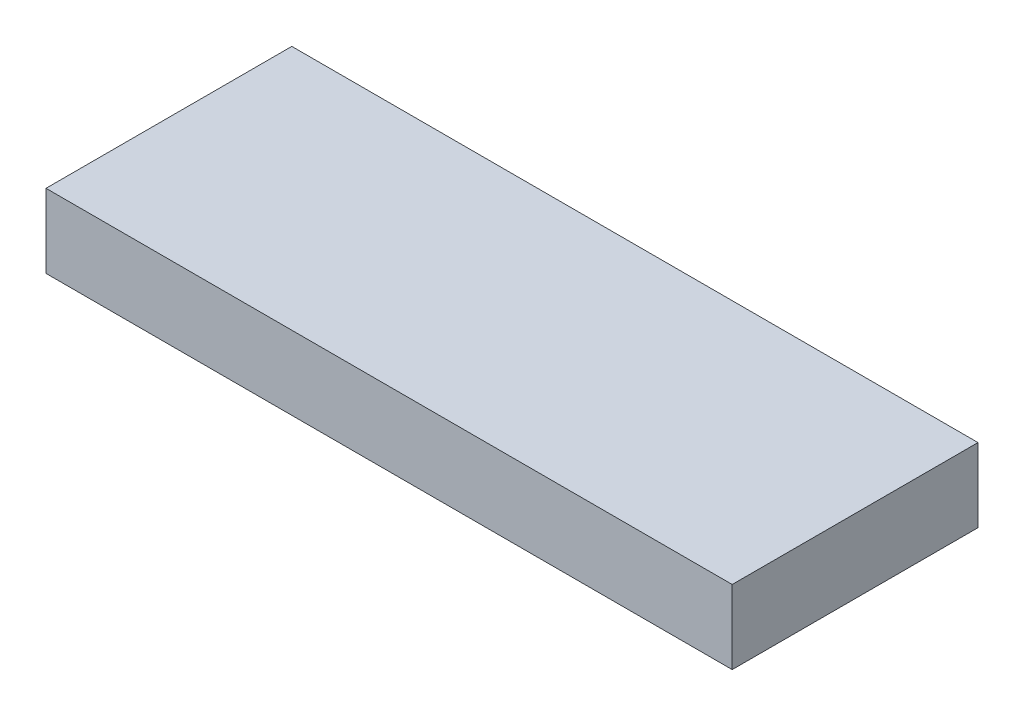
ISO-10303-21;
HEADER;
FILE_DESCRIPTION(('STEP AP214'),'2;1');
FILE_NAME('part.step','',(''),(''),'','','');
FILE_SCHEMA(('AUTOMOTIVE_DESIGN { 1 0 10303 214 1 1 1 1 }'));
ENDSEC;
DATA;
#1=APPLICATION_CONTEXT('core data for automotive mechanical design processes');
#2=APPLICATION_PROTOCOL_DEFINITION('international standard','automotive_design',2000,#1);
#3=PRODUCT_CONTEXT('',#1,'mechanical');
#4=PRODUCT('Part','Part','',(#3));
#5=PRODUCT_RELATED_PRODUCT_CATEGORY('part','',(#4));
#6=PRODUCT_DEFINITION_FORMATION('','',#4);
#7=PRODUCT_DEFINITION_CONTEXT('part definition',#1,'design');
#8=PRODUCT_DEFINITION('design','',#6,#7);
#9=PRODUCT_DEFINITION_SHAPE('','',#8);
#10=(LENGTH_UNIT() NAMED_UNIT(*) SI_UNIT(.MILLI.,.METRE.));
#11=(NAMED_UNIT(*) PLANE_ANGLE_UNIT() SI_UNIT($,.RADIAN.));
#12=(NAMED_UNIT(*) SI_UNIT($,.STERADIAN.) SOLID_ANGLE_UNIT());
#13=UNCERTAINTY_MEASURE_WITH_UNIT(LENGTH_MEASURE(1.E-05),#10,'distance_accuracy_value','');
#14=(GEOMETRIC_REPRESENTATION_CONTEXT(3) GLOBAL_UNCERTAINTY_ASSIGNED_CONTEXT((#13)) GLOBAL_UNIT_ASSIGNED_CONTEXT((#10,
#11,#12)) REPRESENTATION_CONTEXT('',''));
#15=CARTESIAN_POINT('',(0.,0.,0.));
#16=DIRECTION('',(0.,0.,1.));
#17=DIRECTION('',(1.,0.,0.));
#18=AXIS2_PLACEMENT_3D('',#15,#16,#17);
#19=CARTESIAN_POINT('',(-300.,46.99,40.));
#20=DIRECTION('',(0.,0.,-1.));
#21=DIRECTION('',(-1.,0.,0.));
#22=AXIS2_PLACEMENT_3D('',#19,#20,#21);
#23=PLANE('',#22);
#24=DIRECTION('',(0.,1.,0.));
#25=VECTOR('',#24,1.);
#26=CARTESIAN_POINT('',(-272.082574829783,46.99,40.));
#27=LINE('',#26,#25);
#28=CARTESIAN_POINT('',(-272.082574829783,47.,40.));
#29=VERTEX_POINT('',#28);
#30=CARTESIAN_POINT('',(-272.082574829783,50.,40.));
#31=VERTEX_POINT('',#30);
#32=EDGE_CURVE('E11',#29,#31,#27,.T.);
#33=ORIENTED_EDGE('',*,*,#32,.F.);
#34=DIRECTION('',(-1.,0.,0.));
#35=VECTOR('',#34,1.);
#36=CARTESIAN_POINT('',(300.,47.,40.));
#37=LINE('',#36,#35);
#38=CARTESIAN_POINT('',(-300.,47.,40.));
#39=VERTEX_POINT('',#38);
#40=EDGE_CURVE('E77',#29,#39,#37,.T.);
#41=ORIENTED_EDGE('',*,*,#40,.T.);
#42=DIRECTION('',(0.,-1.,0.));
#43=VECTOR('',#42,1.);
#44=CARTESIAN_POINT('',(-300.,46.99,40.));
#45=LINE('',#44,#43);
#46=CARTESIAN_POINT('',(-300.,50.,40.));
#47=VERTEX_POINT('',#46);
#48=EDGE_CURVE('E49',#47,#39,#45,.T.);
#49=ORIENTED_EDGE('',*,*,#48,.F.);
#50=DIRECTION('',(1.,0.,0.));
#51=VECTOR('',#50,1.);
#52=CARTESIAN_POINT('',(-300.,50.,40.));
#53=LINE('',#52,#51);
#54=EDGE_CURVE('E80',#47,#31,#53,.T.);
#55=ORIENTED_EDGE('',*,*,#54,.T.);
#56=EDGE_LOOP('',(#33,#41,#49,#55));
#57=FACE_BOUND('',#56,.T.);
#58=ADVANCED_FACE('F34',(#57),#23,.T.);
#59=CARTESIAN_POINT('',(-300.,46.99,50.));
#60=DIRECTION('',(0.,0.,1.));
#61=DIRECTION('',(1.,0.,0.));
#62=AXIS2_PLACEMENT_3D('',#59,#60,#61);
#63=PLANE('',#62);
#64=DIRECTION('',(0.,1.,0.));
#65=VECTOR('',#64,1.);
#66=CARTESIAN_POINT('',(-300.,46.99,50.));
#67=LINE('',#66,#65);
#68=CARTESIAN_POINT('',(-300.,47.,50.));
#69=VERTEX_POINT('',#68);
#70=CARTESIAN_POINT('',(-300.,50.,50.));
#71=VERTEX_POINT('',#70);
#72=EDGE_CURVE('E57',#69,#71,#67,.T.);
#73=ORIENTED_EDGE('',*,*,#72,.F.);
#74=DIRECTION('',(1.,0.,0.));
#75=VECTOR('',#74,1.);
#76=CARTESIAN_POINT('',(300.,47.,50.));
#77=LINE('',#76,#75);
#78=CARTESIAN_POINT('',(-272.082574829783,47.,50.));
#79=VERTEX_POINT('',#78);
#80=EDGE_CURVE('E88',#69,#79,#77,.T.);
#81=ORIENTED_EDGE('',*,*,#80,.T.);
#82=DIRECTION('',(0.,1.,0.));
#83=VECTOR('',#82,1.);
#84=CARTESIAN_POINT('',(-272.082574829783,46.99,50.));
#85=LINE('',#84,#83);
#86=CARTESIAN_POINT('',(-272.082574829783,50.,50.));
#87=VERTEX_POINT('',#86);
#88=EDGE_CURVE('E42',#79,#87,#85,.T.);
#89=ORIENTED_EDGE('',*,*,#88,.T.);
#90=DIRECTION('',(-1.,0.,0.));
#91=VECTOR('',#90,1.);
#92=CARTESIAN_POINT('',(-300.,50.,50.));
#93=LINE('',#92,#91);
#94=EDGE_CURVE('E101',#87,#71,#93,.T.);
#95=ORIENTED_EDGE('',*,*,#94,.T.);
#96=EDGE_LOOP('',(#73,#81,#89,#95));
#97=FACE_BOUND('',#96,.T.);
#98=ADVANCED_FACE('F105',(#97),#63,.T.);
#99=CARTESIAN_POINT('',(-272.082574829783,46.99,40.));
#100=DIRECTION('',(1.,0.,0.));
#101=DIRECTION('',(0.,0.,-1.));
#102=AXIS2_PLACEMENT_3D('',#99,#100,#101);
#103=PLANE('',#102);
#104=ORIENTED_EDGE('',*,*,#88,.F.);
#105=DIRECTION('',(0.,0.,-1.));
#106=VECTOR('',#105,1.);
#107=CARTESIAN_POINT('',(-272.082574829783,47.,3.));
#108=LINE('',#107,#106);
#109=EDGE_CURVE('E85',#79,#29,#108,.T.);
#110=ORIENTED_EDGE('',*,*,#109,.T.);
#111=ORIENTED_EDGE('',*,*,#32,.T.);
#112=DIRECTION('',(0.,0.,1.));
#113=VECTOR('',#112,1.);
#114=CARTESIAN_POINT('',(-272.082574829783,50.,60.));
#115=LINE('',#114,#113);
#116=EDGE_CURVE('E103',#31,#87,#115,.T.);
#117=ORIENTED_EDGE('',*,*,#116,.T.);
#118=EDGE_LOOP('',(#104,#110,#111,#117));
#119=FACE_BOUND('',#118,.T.);
#120=ADVANCED_FACE('F86',(#119),#103,.T.);
#121=CARTESIAN_POINT('',(-300.,0.,0.));
#122=DIRECTION('',(-1.,0.,0.));
#123=DIRECTION('',(0.,0.,1.));
#124=AXIS2_PLACEMENT_3D('',#121,#122,#123);
#125=PLANE('',#124);
#126=DIRECTION('',(0.,0.,-1.));
#127=VECTOR('',#126,1.);
#128=CARTESIAN_POINT('',(-300.,50.,60.));
#129=LINE('',#128,#127);
#130=EDGE_CURVE('E95',#71,#47,#129,.T.);
#131=ORIENTED_EDGE('',*,*,#130,.T.);
#132=ORIENTED_EDGE('',*,*,#48,.T.);
#133=DIRECTION('',(0.,0.,1.));
#134=VECTOR('',#133,1.);
#135=CARTESIAN_POINT('',(-300.,47.,3.));
#136=LINE('',#135,#134);
#137=EDGE_CURVE('E90',#39,#69,#136,.T.);
#138=ORIENTED_EDGE('',*,*,#137,.T.);
#139=ORIENTED_EDGE('',*,*,#72,.T.);
#140=EDGE_LOOP('',(#131,#132,#138,#139));
#141=FACE_BOUND('',#140,.T.);
#142=ADVANCED_FACE('F106',(#141),#125,.T.);
#143=CARTESIAN_POINT('',(-300.,50.,60.));
#144=DIRECTION('',(0.,-1.,0.));
#145=DIRECTION('',(0.,0.,-1.));
#146=AXIS2_PLACEMENT_3D('',#143,#144,#145);
#147=PLANE('',#146);
#148=ORIENTED_EDGE('',*,*,#54,.F.);
#149=ORIENTED_EDGE('',*,*,#130,.F.);
#150=ORIENTED_EDGE('',*,*,#94,.F.);
#151=ORIENTED_EDGE('',*,*,#116,.F.);
#152=EDGE_LOOP('',(#148,#149,#150,#151));
#153=FACE_BOUND('',#152,.T.);
#154=ADVANCED_FACE('F108',(#153),#147,.F.);
#155=CARTESIAN_POINT('',(300.,47.,3.));
#156=DIRECTION('',(0.,1.,0.));
#157=DIRECTION('',(0.,0.,1.));
#158=AXIS2_PLACEMENT_3D('',#155,#156,#157);
#159=PLANE('',#158);
#160=ORIENTED_EDGE('',*,*,#40,.F.);
#161=ORIENTED_EDGE('',*,*,#109,.F.);
#162=ORIENTED_EDGE('',*,*,#80,.F.);
#163=ORIENTED_EDGE('',*,*,#137,.F.);
#164=EDGE_LOOP('',(#160,#161,#162,#163));
#165=FACE_BOUND('',#164,.T.);
#166=ADVANCED_FACE('F36',(#165),#159,.F.);
#167=CLOSED_SHELL('',(#58,#98,#120,#142,#154,#166));
#168=MANIFOLD_SOLID_BREP('B2',#167);
#169=ADVANCED_BREP_SHAPE_REPRESENTATION('',(#18,#168),#14);
#170=SHAPE_DEFINITION_REPRESENTATION(#9,#169);
ENDSEC;
END-ISO-10303-21;
